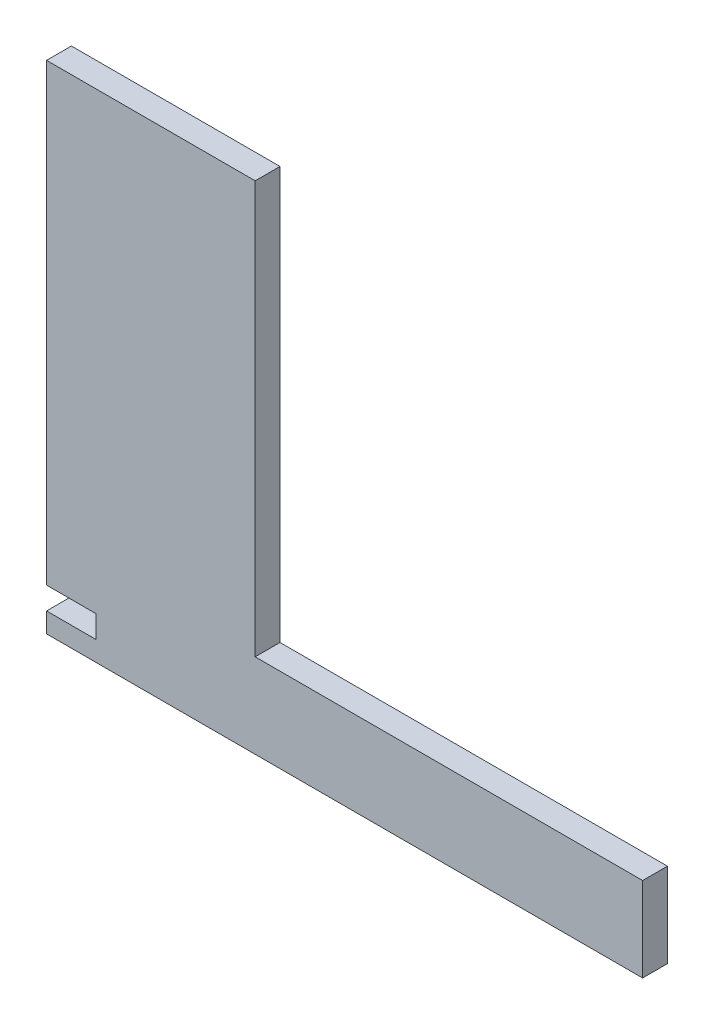
ISO-10303-21;
HEADER;
FILE_DESCRIPTION(('STEP AP214'),'2;1');
FILE_NAME('part.step','',(''),(''),'','','');
FILE_SCHEMA(('AUTOMOTIVE_DESIGN { 1 0 10303 214 1 1 1 1 }'));
ENDSEC;
DATA;
#1=APPLICATION_CONTEXT('core data for automotive mechanical design processes');
#2=APPLICATION_PROTOCOL_DEFINITION('international standard','automotive_design',2000,#1);
#3=PRODUCT_CONTEXT('',#1,'mechanical');
#4=PRODUCT('Part','Part','',(#3));
#5=PRODUCT_RELATED_PRODUCT_CATEGORY('part','',(#4));
#6=PRODUCT_DEFINITION_FORMATION('','',#4);
#7=PRODUCT_DEFINITION_CONTEXT('part definition',#1,'design');
#8=PRODUCT_DEFINITION('design','',#6,#7);
#9=PRODUCT_DEFINITION_SHAPE('','',#8);
#10=(LENGTH_UNIT() NAMED_UNIT(*) SI_UNIT(.MILLI.,.METRE.));
#11=(NAMED_UNIT(*) PLANE_ANGLE_UNIT() SI_UNIT($,.RADIAN.));
#12=(NAMED_UNIT(*) SI_UNIT($,.STERADIAN.) SOLID_ANGLE_UNIT());
#13=UNCERTAINTY_MEASURE_WITH_UNIT(LENGTH_MEASURE(1.E-05),#10,'distance_accuracy_value','');
#14=(GEOMETRIC_REPRESENTATION_CONTEXT(3) GLOBAL_UNCERTAINTY_ASSIGNED_CONTEXT((#13)) GLOBAL_UNIT_ASSIGNED_CONTEXT((#10,
#11,#12)) REPRESENTATION_CONTEXT('',''));
#15=CARTESIAN_POINT('',(0.,0.,0.));
#16=DIRECTION('',(0.,0.,1.));
#17=DIRECTION('',(1.,0.,0.));
#18=AXIS2_PLACEMENT_3D('',#15,#16,#17);
#19=CARTESIAN_POINT('',(-19.1089108910891,5.52970297029703,5.));
#20=DIRECTION('',(0.,1.,0.));
#21=DIRECTION('',(0.,0.,1.));
#22=AXIS2_PLACEMENT_3D('',#19,#20,#21);
#23=PLANE('',#22);
#24=DIRECTION('',(1.,0.,0.));
#25=VECTOR('',#24,1.);
#26=CARTESIAN_POINT('',(-19.1089108910891,5.52970297029703,0.));
#27=LINE('',#26,#25);
#28=CARTESIAN_POINT('',(-19.1089108910891,5.52970297029703,0.));
#29=VERTEX_POINT('',#28);
#30=CARTESIAN_POINT('',(-9.10891089108911,5.52970297029703,0.));
#31=VERTEX_POINT('',#30);
#32=EDGE_CURVE('E152',#29,#31,#27,.T.);
#33=ORIENTED_EDGE('',*,*,#32,.T.);
#34=DIRECTION('',(0.,0.,-1.));
#35=VECTOR('',#34,1.);
#36=CARTESIAN_POINT('',(-9.10891089108911,5.52970297029703,5.));
#37=LINE('',#36,#35);
#38=CARTESIAN_POINT('',(-9.10891089108911,5.52970297029703,5.));
#39=VERTEX_POINT('',#38);
#40=EDGE_CURVE('E11',#39,#31,#37,.T.);
#41=ORIENTED_EDGE('',*,*,#40,.F.);
#42=DIRECTION('',(1.,0.,0.));
#43=VECTOR('',#42,1.);
#44=CARTESIAN_POINT('',(-19.1089108910891,5.52970297029703,5.));
#45=LINE('',#44,#43);
#46=CARTESIAN_POINT('',(-19.1089108910891,5.52970297029703,5.));
#47=VERTEX_POINT('',#46);
#48=EDGE_CURVE('E180',#47,#39,#45,.T.);
#49=ORIENTED_EDGE('',*,*,#48,.F.);
#50=DIRECTION('',(0.,0.,-1.));
#51=VECTOR('',#50,1.);
#52=CARTESIAN_POINT('',(-19.1089108910891,5.52970297029703,5.));
#53=LINE('',#52,#51);
#54=EDGE_CURVE('E148',#47,#29,#53,.T.);
#55=ORIENTED_EDGE('',*,*,#54,.T.);
#56=EDGE_LOOP('',(#33,#41,#49,#55));
#57=FACE_BOUND('',#56,.T.);
#58=ADVANCED_FACE('F39',(#57),#23,.F.);
#59=CARTESIAN_POINT('',(-9.10891089108911,5.52970297029703,5.));
#60=DIRECTION('',(1.,0.,0.));
#61=DIRECTION('',(0.,0.,-1.));
#62=AXIS2_PLACEMENT_3D('',#59,#60,#61);
#63=PLANE('',#62);
#64=DIRECTION('',(0.,-1.,0.));
#65=VECTOR('',#64,1.);
#66=CARTESIAN_POINT('',(-9.10891089108911,5.52970297029703,0.));
#67=LINE('',#66,#65);
#68=CARTESIAN_POINT('',(-9.10891089108911,1.02970297029703,0.));
#69=VERTEX_POINT('',#68);
#70=EDGE_CURVE('E156',#31,#69,#67,.T.);
#71=ORIENTED_EDGE('',*,*,#70,.T.);
#72=DIRECTION('',(0.,0.,-1.));
#73=VECTOR('',#72,1.);
#74=CARTESIAN_POINT('',(-9.10891089108911,1.02970297029703,5.));
#75=LINE('',#74,#73);
#76=CARTESIAN_POINT('',(-9.10891089108911,1.02970297029703,5.));
#77=VERTEX_POINT('',#76);
#78=EDGE_CURVE('E48',#77,#69,#75,.T.);
#79=ORIENTED_EDGE('',*,*,#78,.F.);
#80=DIRECTION('',(0.,-1.,0.));
#81=VECTOR('',#80,1.);
#82=CARTESIAN_POINT('',(-9.10891089108911,5.52970297029703,5.));
#83=LINE('',#82,#81);
#84=EDGE_CURVE('E105',#39,#77,#83,.T.);
#85=ORIENTED_EDGE('',*,*,#84,.F.);
#86=ORIENTED_EDGE('',*,*,#40,.T.);
#87=EDGE_LOOP('',(#71,#79,#85,#86));
#88=FACE_BOUND('',#87,.T.);
#89=ADVANCED_FACE('F244',(#88),#63,.F.);
#90=CARTESIAN_POINT('',(-9.10891089108911,1.02970297029703,5.));
#91=DIRECTION('',(0.,-1.,0.));
#92=DIRECTION('',(1.,0.,0.));
#93=AXIS2_PLACEMENT_3D('',#90,#91,#92);
#94=PLANE('',#93);
#95=DIRECTION('',(-1.,0.,0.));
#96=VECTOR('',#95,1.);
#97=CARTESIAN_POINT('',(-9.10891089108911,1.02970297029703,0.));
#98=LINE('',#97,#96);
#99=CARTESIAN_POINT('',(-19.1089108910891,1.02970297029703,0.));
#100=VERTEX_POINT('',#99);
#101=EDGE_CURVE('E159',#69,#100,#98,.T.);
#102=ORIENTED_EDGE('',*,*,#101,.T.);
#103=DIRECTION('',(0.,0.,-1.));
#104=VECTOR('',#103,1.);
#105=CARTESIAN_POINT('',(-19.1089108910891,1.02970297029703,5.));
#106=LINE('',#105,#104);
#107=CARTESIAN_POINT('',(-19.1089108910891,1.02970297029703,5.));
#108=VERTEX_POINT('',#107);
#109=EDGE_CURVE('E199',#108,#100,#106,.T.);
#110=ORIENTED_EDGE('',*,*,#109,.F.);
#111=DIRECTION('',(-1.,0.,0.));
#112=VECTOR('',#111,1.);
#113=CARTESIAN_POINT('',(-9.10891089108911,1.02970297029703,5.));
#114=LINE('',#113,#112);
#115=EDGE_CURVE('E209',#77,#108,#114,.T.);
#116=ORIENTED_EDGE('',*,*,#115,.F.);
#117=ORIENTED_EDGE('',*,*,#78,.T.);
#118=EDGE_LOOP('',(#102,#110,#116,#117));
#119=FACE_BOUND('',#118,.T.);
#120=ADVANCED_FACE('F207',(#119),#94,.F.);
#121=CARTESIAN_POINT('',(-19.1089108910891,1.02970297029703,5.));
#122=DIRECTION('',(1.,0.,0.));
#123=DIRECTION('',(0.,0.,-1.));
#124=AXIS2_PLACEMENT_3D('',#121,#122,#123);
#125=PLANE('',#124);
#126=DIRECTION('',(0.,-1.,0.));
#127=VECTOR('',#126,1.);
#128=CARTESIAN_POINT('',(-19.1089108910891,1.02970297029703,0.));
#129=LINE('',#128,#127);
#130=CARTESIAN_POINT('',(-19.1089108910891,-2.97029702970297,0.));
#131=VERTEX_POINT('',#130);
#132=EDGE_CURVE('E162',#100,#131,#129,.T.);
#133=ORIENTED_EDGE('',*,*,#132,.T.);
#134=DIRECTION('',(0.,0.,-1.));
#135=VECTOR('',#134,1.);
#136=CARTESIAN_POINT('',(-19.1089108910891,-2.97029702970297,5.));
#137=LINE('',#136,#135);
#138=CARTESIAN_POINT('',(-19.1089108910891,-2.97029702970297,5.));
#139=VERTEX_POINT('',#138);
#140=EDGE_CURVE('E195',#139,#131,#137,.T.);
#141=ORIENTED_EDGE('',*,*,#140,.F.);
#142=DIRECTION('',(0.,-1.,0.));
#143=VECTOR('',#142,1.);
#144=CARTESIAN_POINT('',(-19.1089108910891,1.02970297029703,5.));
#145=LINE('',#144,#143);
#146=EDGE_CURVE('E228',#108,#139,#145,.T.);
#147=ORIENTED_EDGE('',*,*,#146,.F.);
#148=ORIENTED_EDGE('',*,*,#109,.T.);
#149=EDGE_LOOP('',(#133,#141,#147,#148));
#150=FACE_BOUND('',#149,.T.);
#151=ADVANCED_FACE('F218',(#150),#125,.F.);
#152=CARTESIAN_POINT('',(-19.1089108910891,-2.97029702970297,5.));
#153=DIRECTION('',(0.,1.,0.));
#154=DIRECTION('',(0.,0.,1.));
#155=AXIS2_PLACEMENT_3D('',#152,#153,#154);
#156=PLANE('',#155);
#157=DIRECTION('',(1.,0.,0.));
#158=VECTOR('',#157,1.);
#159=CARTESIAN_POINT('',(-19.1089108910891,-2.97029702970297,0.));
#160=LINE('',#159,#158);
#161=CARTESIAN_POINT('',(100.891089108911,-2.97029702970297,0.));
#162=VERTEX_POINT('',#161);
#163=EDGE_CURVE('E165',#131,#162,#160,.T.);
#164=ORIENTED_EDGE('',*,*,#163,.T.);
#165=DIRECTION('',(0.,0.,-1.));
#166=VECTOR('',#165,1.);
#167=CARTESIAN_POINT('',(100.891089108911,-2.97029702970297,5.));
#168=LINE('',#167,#166);
#169=CARTESIAN_POINT('',(100.891089108911,-2.97029702970297,5.));
#170=VERTEX_POINT('',#169);
#171=EDGE_CURVE('E191',#170,#162,#168,.T.);
#172=ORIENTED_EDGE('',*,*,#171,.F.);
#173=DIRECTION('',(1.,0.,0.));
#174=VECTOR('',#173,1.);
#175=CARTESIAN_POINT('',(-19.1089108910891,-2.97029702970297,5.));
#176=LINE('',#175,#174);
#177=EDGE_CURVE('E224',#139,#170,#176,.T.);
#178=ORIENTED_EDGE('',*,*,#177,.F.);
#179=ORIENTED_EDGE('',*,*,#140,.T.);
#180=EDGE_LOOP('',(#164,#172,#178,#179));
#181=FACE_BOUND('',#180,.T.);
#182=ADVANCED_FACE('F222',(#181),#156,.F.);
#183=CARTESIAN_POINT('',(100.891089108911,-2.97029702970297,5.));
#184=DIRECTION('',(-1.,0.,0.));
#185=DIRECTION('',(0.,0.,1.));
#186=AXIS2_PLACEMENT_3D('',#183,#184,#185);
#187=PLANE('',#186);
#188=DIRECTION('',(0.,1.,0.));
#189=VECTOR('',#188,1.);
#190=CARTESIAN_POINT('',(100.891089108911,-2.97029702970297,0.));
#191=LINE('',#190,#189);
#192=CARTESIAN_POINT('',(100.891089108911,14.029702970297,0.));
#193=VERTEX_POINT('',#192);
#194=EDGE_CURVE('E168',#162,#193,#191,.T.);
#195=ORIENTED_EDGE('',*,*,#194,.T.);
#196=DIRECTION('',(0.,0.,-1.));
#197=VECTOR('',#196,1.);
#198=CARTESIAN_POINT('',(100.891089108911,14.029702970297,5.));
#199=LINE('',#198,#197);
#200=CARTESIAN_POINT('',(100.891089108911,14.029702970297,5.));
#201=VERTEX_POINT('',#200);
#202=EDGE_CURVE('E187',#201,#193,#199,.T.);
#203=ORIENTED_EDGE('',*,*,#202,.F.);
#204=DIRECTION('',(0.,1.,0.));
#205=VECTOR('',#204,1.);
#206=CARTESIAN_POINT('',(100.891089108911,-2.97029702970297,5.));
#207=LINE('',#206,#205);
#208=EDGE_CURVE('E227',#170,#201,#207,.T.);
#209=ORIENTED_EDGE('',*,*,#208,.F.);
#210=ORIENTED_EDGE('',*,*,#171,.T.);
#211=EDGE_LOOP('',(#195,#203,#209,#210));
#212=FACE_BOUND('',#211,.T.);
#213=ADVANCED_FACE('F256',(#212),#187,.F.);
#214=CARTESIAN_POINT('',(100.891089108911,14.029702970297,5.));
#215=DIRECTION('',(0.,-1.,0.));
#216=DIRECTION('',(1.,0.,0.));
#217=AXIS2_PLACEMENT_3D('',#214,#215,#216);
#218=PLANE('',#217);
#219=DIRECTION('',(-1.,0.,0.));
#220=VECTOR('',#219,1.);
#221=CARTESIAN_POINT('',(100.891089108911,14.029702970297,0.));
#222=LINE('',#221,#220);
#223=CARTESIAN_POINT('',(22.8910891089109,14.029702970297,0.));
#224=VERTEX_POINT('',#223);
#225=EDGE_CURVE('E171',#193,#224,#222,.T.);
#226=ORIENTED_EDGE('',*,*,#225,.T.);
#227=DIRECTION('',(0.,0.,-1.));
#228=VECTOR('',#227,1.);
#229=CARTESIAN_POINT('',(22.8910891089109,14.029702970297,5.));
#230=LINE('',#229,#228);
#231=CARTESIAN_POINT('',(22.8910891089109,14.029702970297,5.));
#232=VERTEX_POINT('',#231);
#233=EDGE_CURVE('E141',#232,#224,#230,.T.);
#234=ORIENTED_EDGE('',*,*,#233,.F.);
#235=DIRECTION('',(-1.,0.,0.));
#236=VECTOR('',#235,1.);
#237=CARTESIAN_POINT('',(100.891089108911,14.029702970297,5.));
#238=LINE('',#237,#236);
#239=EDGE_CURVE('E130',#201,#232,#238,.T.);
#240=ORIENTED_EDGE('',*,*,#239,.F.);
#241=ORIENTED_EDGE('',*,*,#202,.T.);
#242=EDGE_LOOP('',(#226,#234,#240,#241));
#243=FACE_BOUND('',#242,.T.);
#244=ADVANCED_FACE('F259',(#243),#218,.F.);
#245=CARTESIAN_POINT('',(22.8910891089109,14.029702970297,5.));
#246=DIRECTION('',(-1.,0.,0.));
#247=DIRECTION('',(0.,-1.,0.));
#248=AXIS2_PLACEMENT_3D('',#245,#246,#247);
#249=PLANE('',#248);
#250=DIRECTION('',(0.,1.,0.));
#251=VECTOR('',#250,1.);
#252=CARTESIAN_POINT('',(22.8910891089109,14.029702970297,0.));
#253=LINE('',#252,#251);
#254=CARTESIAN_POINT('',(22.8910891089109,97.029702970297,0.));
#255=VERTEX_POINT('',#254);
#256=EDGE_CURVE('E139',#224,#255,#253,.T.);
#257=ORIENTED_EDGE('',*,*,#256,.T.);
#258=DIRECTION('',(0.,0.,-1.));
#259=VECTOR('',#258,1.);
#260=CARTESIAN_POINT('',(22.8910891089109,97.029702970297,5.));
#261=LINE('',#260,#259);
#262=CARTESIAN_POINT('',(22.8910891089109,97.029702970297,5.));
#263=VERTEX_POINT('',#262);
#264=EDGE_CURVE('E136',#263,#255,#261,.T.);
#265=ORIENTED_EDGE('',*,*,#264,.F.);
#266=DIRECTION('',(0.,1.,0.));
#267=VECTOR('',#266,1.);
#268=CARTESIAN_POINT('',(22.8910891089109,14.029702970297,5.));
#269=LINE('',#268,#267);
#270=EDGE_CURVE('E124',#232,#263,#269,.T.);
#271=ORIENTED_EDGE('',*,*,#270,.F.);
#272=ORIENTED_EDGE('',*,*,#233,.T.);
#273=EDGE_LOOP('',(#257,#265,#271,#272));
#274=FACE_BOUND('',#273,.T.);
#275=ADVANCED_FACE('F137',(#274),#249,.F.);
#276=CARTESIAN_POINT('',(22.8910891089109,97.029702970297,5.));
#277=DIRECTION('',(0.,-1.,0.));
#278=DIRECTION('',(0.,0.,-1.));
#279=AXIS2_PLACEMENT_3D('',#276,#277,#278);
#280=PLANE('',#279);
#281=DIRECTION('',(-1.,0.,0.));
#282=VECTOR('',#281,1.);
#283=CARTESIAN_POINT('',(22.8910891089109,97.029702970297,0.));
#284=LINE('',#283,#282);
#285=CARTESIAN_POINT('',(-19.1089108910891,97.029702970297,0.));
#286=VERTEX_POINT('',#285);
#287=EDGE_CURVE('E91',#255,#286,#284,.T.);
#288=ORIENTED_EDGE('',*,*,#287,.T.);
#289=DIRECTION('',(0.,0.,-1.));
#290=VECTOR('',#289,1.);
#291=CARTESIAN_POINT('',(-19.1089108910891,97.029702970297,5.));
#292=LINE('',#291,#290);
#293=CARTESIAN_POINT('',(-19.1089108910891,97.029702970297,5.));
#294=VERTEX_POINT('',#293);
#295=EDGE_CURVE('E142',#294,#286,#292,.T.);
#296=ORIENTED_EDGE('',*,*,#295,.F.);
#297=DIRECTION('',(-1.,0.,0.));
#298=VECTOR('',#297,1.);
#299=CARTESIAN_POINT('',(22.8910891089109,97.029702970297,5.));
#300=LINE('',#299,#298);
#301=EDGE_CURVE('E128',#263,#294,#300,.T.);
#302=ORIENTED_EDGE('',*,*,#301,.F.);
#303=ORIENTED_EDGE('',*,*,#264,.T.);
#304=EDGE_LOOP('',(#288,#296,#302,#303));
#305=FACE_BOUND('',#304,.T.);
#306=ADVANCED_FACE('F144',(#305),#280,.F.);
#307=CARTESIAN_POINT('',(-19.1089108910891,97.029702970297,5.));
#308=DIRECTION('',(1.,0.,0.));
#309=DIRECTION('',(0.,1.,0.));
#310=AXIS2_PLACEMENT_3D('',#307,#308,#309);
#311=PLANE('',#310);
#312=DIRECTION('',(0.,-1.,0.));
#313=VECTOR('',#312,1.);
#314=CARTESIAN_POINT('',(-19.1089108910891,97.029702970297,0.));
#315=LINE('',#314,#313);
#316=EDGE_CURVE('E97',#286,#29,#315,.T.);
#317=ORIENTED_EDGE('',*,*,#316,.T.);
#318=ORIENTED_EDGE('',*,*,#54,.F.);
#319=DIRECTION('',(0.,-1.,0.));
#320=VECTOR('',#319,1.);
#321=CARTESIAN_POINT('',(-19.1089108910891,97.029702970297,5.));
#322=LINE('',#321,#320);
#323=EDGE_CURVE('E56',#294,#47,#322,.T.);
#324=ORIENTED_EDGE('',*,*,#323,.F.);
#325=ORIENTED_EDGE('',*,*,#295,.T.);
#326=EDGE_LOOP('',(#317,#318,#324,#325));
#327=FACE_BOUND('',#326,.T.);
#328=ADVANCED_FACE('F268',(#327),#311,.F.);
#329=CARTESIAN_POINT('',(0.,0.,5.));
#330=DIRECTION('',(0.,0.,-1.));
#331=DIRECTION('',(-1.,0.,0.));
#332=AXIS2_PLACEMENT_3D('',#329,#330,#331);
#333=PLANE('',#332);
#334=ORIENTED_EDGE('',*,*,#48,.T.);
#335=ORIENTED_EDGE('',*,*,#84,.T.);
#336=ORIENTED_EDGE('',*,*,#115,.T.);
#337=ORIENTED_EDGE('',*,*,#146,.T.);
#338=ORIENTED_EDGE('',*,*,#177,.T.);
#339=ORIENTED_EDGE('',*,*,#208,.T.);
#340=ORIENTED_EDGE('',*,*,#239,.T.);
#341=ORIENTED_EDGE('',*,*,#270,.T.);
#342=ORIENTED_EDGE('',*,*,#301,.T.);
#343=ORIENTED_EDGE('',*,*,#323,.T.);
#344=EDGE_LOOP('',(#334,#335,#336,#337,#338,#339,#340,#341,#342,#343));
#345=FACE_BOUND('',#344,.T.);
#346=ADVANCED_FACE('F126',(#345),#333,.F.);
#347=CARTESIAN_POINT('',(0.,0.,0.));
#348=DIRECTION('',(0.,0.,-1.));
#349=DIRECTION('',(-1.,0.,0.));
#350=AXIS2_PLACEMENT_3D('',#347,#348,#349);
#351=PLANE('',#350);
#352=ORIENTED_EDGE('',*,*,#32,.F.);
#353=ORIENTED_EDGE('',*,*,#316,.F.);
#354=ORIENTED_EDGE('',*,*,#287,.F.);
#355=ORIENTED_EDGE('',*,*,#256,.F.);
#356=ORIENTED_EDGE('',*,*,#225,.F.);
#357=ORIENTED_EDGE('',*,*,#194,.F.);
#358=ORIENTED_EDGE('',*,*,#163,.F.);
#359=ORIENTED_EDGE('',*,*,#132,.F.);
#360=ORIENTED_EDGE('',*,*,#101,.F.);
#361=ORIENTED_EDGE('',*,*,#70,.F.);
#362=EDGE_LOOP('',(#352,#353,#354,#355,#356,#357,#358,#359,#360,#361));
#363=FACE_BOUND('',#362,.T.);
#364=ADVANCED_FACE('F213',(#363),#351,.T.);
#365=CLOSED_SHELL('',(#58,#89,#120,#151,#182,#213,#244,#275,#306,#328,#346,#364));
#366=MANIFOLD_SOLID_BREP('B2',#365);
#367=ADVANCED_BREP_SHAPE_REPRESENTATION('',(#18,#366),#14);
#368=SHAPE_DEFINITION_REPRESENTATION(#9,#367);
ENDSEC;
END-ISO-10303-21;
